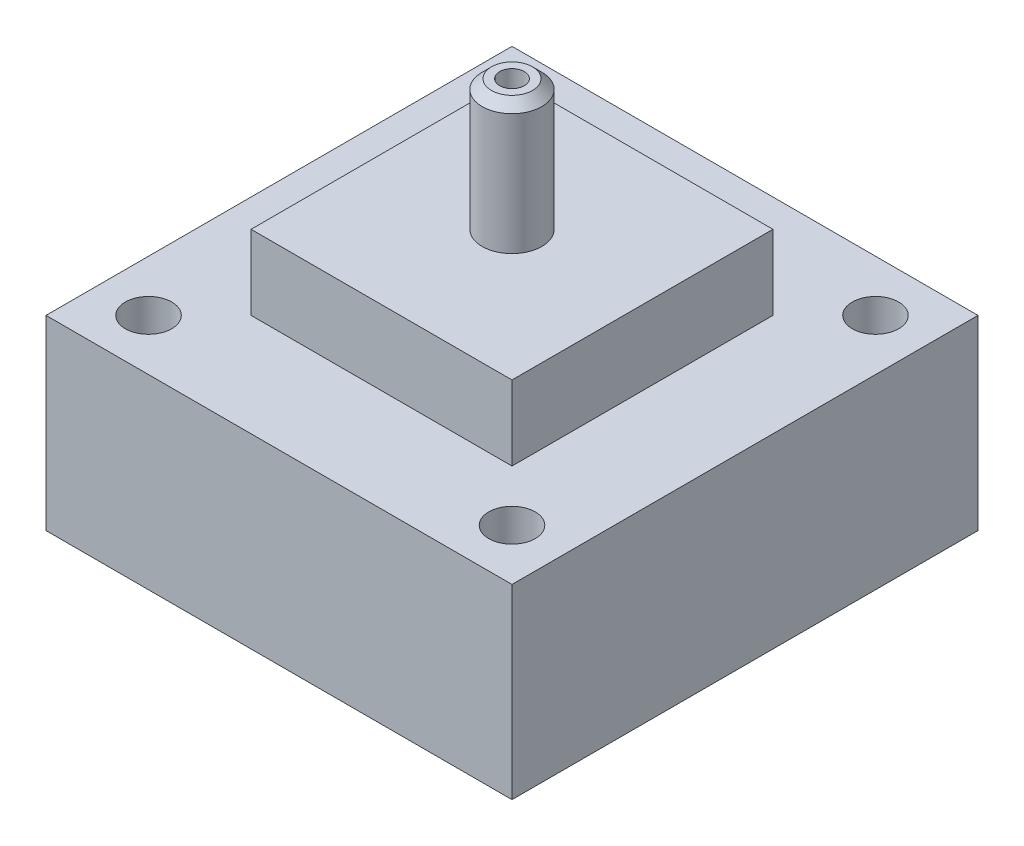
ISO-10303-21;
HEADER;
FILE_DESCRIPTION(('STEP AP214'),'2;1');
FILE_NAME('part.step','',(''),(''),'','','');
FILE_SCHEMA(('AUTOMOTIVE_DESIGN { 1 0 10303 214 1 1 1 1 }'));
ENDSEC;
DATA;
#1=APPLICATION_CONTEXT('core data for automotive mechanical design processes');
#2=APPLICATION_PROTOCOL_DEFINITION('international standard','automotive_design',2000,#1);
#3=PRODUCT_CONTEXT('',#1,'mechanical');
#4=PRODUCT('Part','Part','',(#3));
#5=PRODUCT_RELATED_PRODUCT_CATEGORY('part','',(#4));
#6=PRODUCT_DEFINITION_FORMATION('','',#4);
#7=PRODUCT_DEFINITION_CONTEXT('part definition',#1,'design');
#8=PRODUCT_DEFINITION('design','',#6,#7);
#9=PRODUCT_DEFINITION_SHAPE('','',#8);
#10=(LENGTH_UNIT() NAMED_UNIT(*) SI_UNIT(.MILLI.,.METRE.));
#11=(NAMED_UNIT(*) PLANE_ANGLE_UNIT() SI_UNIT($,.RADIAN.));
#12=(NAMED_UNIT(*) SI_UNIT($,.STERADIAN.) SOLID_ANGLE_UNIT());
#13=UNCERTAINTY_MEASURE_WITH_UNIT(LENGTH_MEASURE(1.E-05),#10,'distance_accuracy_value','');
#14=(GEOMETRIC_REPRESENTATION_CONTEXT(3) GLOBAL_UNCERTAINTY_ASSIGNED_CONTEXT((#13)) GLOBAL_UNIT_ASSIGNED_CONTEXT((#10,
#11,#12)) REPRESENTATION_CONTEXT('',''));
#15=CARTESIAN_POINT('',(0.,0.,0.));
#16=DIRECTION('',(0.,0.,1.));
#17=DIRECTION('',(1.,0.,0.));
#18=AXIS2_PLACEMENT_3D('',#15,#16,#17);
#19=CARTESIAN_POINT('',(-7.,4.,7.));
#20=DIRECTION('',(1.,0.,0.));
#21=DIRECTION('',(0.,0.,-1.));
#22=AXIS2_PLACEMENT_3D('',#19,#20,#21);
#23=PLANE('',#22);
#24=DIRECTION('',(0.,0.,1.));
#25=VECTOR('',#24,1.);
#26=CARTESIAN_POINT('',(-7.,0.,7.));
#27=LINE('',#26,#25);
#28=CARTESIAN_POINT('',(-7.,0.,-7.));
#29=VERTEX_POINT('',#28);
#30=CARTESIAN_POINT('',(-7.,0.,7.));
#31=VERTEX_POINT('',#30);
#32=EDGE_CURVE('E126',#29,#31,#27,.T.);
#33=ORIENTED_EDGE('',*,*,#32,.T.);
#34=DIRECTION('',(0.,-1.,0.));
#35=VECTOR('',#34,1.);
#36=CARTESIAN_POINT('',(-7.,4.,7.));
#37=LINE('',#36,#35);
#38=CARTESIAN_POINT('',(-7.,4.,7.));
#39=VERTEX_POINT('',#38);
#40=EDGE_CURVE('E11',#39,#31,#37,.T.);
#41=ORIENTED_EDGE('',*,*,#40,.F.);
#42=DIRECTION('',(0.,0.,1.));
#43=VECTOR('',#42,1.);
#44=CARTESIAN_POINT('',(-7.,4.,7.));
#45=LINE('',#44,#43);
#46=CARTESIAN_POINT('',(-7.,4.,-7.));
#47=VERTEX_POINT('',#46);
#48=EDGE_CURVE('E135',#47,#39,#45,.T.);
#49=ORIENTED_EDGE('',*,*,#48,.F.);
#50=DIRECTION('',(0.,-1.,0.));
#51=VECTOR('',#50,1.);
#52=CARTESIAN_POINT('',(-7.,4.,-7.));
#53=LINE('',#52,#51);
#54=EDGE_CURVE('E142',#47,#29,#53,.T.);
#55=ORIENTED_EDGE('',*,*,#54,.T.);
#56=EDGE_LOOP('',(#33,#41,#49,#55));
#57=FACE_BOUND('',#56,.T.);
#58=ADVANCED_FACE('F39',(#57),#23,.F.);
#59=CARTESIAN_POINT('',(-7.,4.,7.));
#60=DIRECTION('',(0.,0.,-1.));
#61=DIRECTION('',(-1.,0.,0.));
#62=AXIS2_PLACEMENT_3D('',#59,#60,#61);
#63=PLANE('',#62);
#64=DIRECTION('',(1.,0.,0.));
#65=VECTOR('',#64,1.);
#66=CARTESIAN_POINT('',(-7.,0.,7.));
#67=LINE('',#66,#65);
#68=CARTESIAN_POINT('',(7.,0.,7.));
#69=VERTEX_POINT('',#68);
#70=EDGE_CURVE('E129',#31,#69,#67,.T.);
#71=ORIENTED_EDGE('',*,*,#70,.T.);
#72=DIRECTION('',(0.,-1.,0.));
#73=VECTOR('',#72,1.);
#74=CARTESIAN_POINT('',(7.,4.,7.));
#75=LINE('',#74,#73);
#76=CARTESIAN_POINT('',(7.,4.,7.));
#77=VERTEX_POINT('',#76);
#78=EDGE_CURVE('E48',#77,#69,#75,.T.);
#79=ORIENTED_EDGE('',*,*,#78,.F.);
#80=DIRECTION('',(1.,0.,0.));
#81=VECTOR('',#80,1.);
#82=CARTESIAN_POINT('',(-7.,4.,7.));
#83=LINE('',#82,#81);
#84=EDGE_CURVE('E137',#39,#77,#83,.T.);
#85=ORIENTED_EDGE('',*,*,#84,.F.);
#86=ORIENTED_EDGE('',*,*,#40,.T.);
#87=EDGE_LOOP('',(#71,#79,#85,#86));
#88=FACE_BOUND('',#87,.T.);
#89=ADVANCED_FACE('F164',(#88),#63,.F.);
#90=CARTESIAN_POINT('',(7.,4.,7.));
#91=DIRECTION('',(-1.,0.,0.));
#92=DIRECTION('',(0.,0.,1.));
#93=AXIS2_PLACEMENT_3D('',#90,#91,#92);
#94=PLANE('',#93);
#95=DIRECTION('',(0.,0.,-1.));
#96=VECTOR('',#95,1.);
#97=CARTESIAN_POINT('',(7.,0.,7.));
#98=LINE('',#97,#96);
#99=CARTESIAN_POINT('',(7.,0.,-7.));
#100=VERTEX_POINT('',#99);
#101=EDGE_CURVE('E146',#69,#100,#98,.T.);
#102=ORIENTED_EDGE('',*,*,#101,.T.);
#103=DIRECTION('',(0.,-1.,0.));
#104=VECTOR('',#103,1.);
#105=CARTESIAN_POINT('',(7.,4.,-7.));
#106=LINE('',#105,#104);
#107=CARTESIAN_POINT('',(7.,4.,-7.));
#108=VERTEX_POINT('',#107);
#109=EDGE_CURVE('E153',#108,#100,#106,.T.);
#110=ORIENTED_EDGE('',*,*,#109,.F.);
#111=DIRECTION('',(0.,0.,-1.));
#112=VECTOR('',#111,1.);
#113=CARTESIAN_POINT('',(7.,4.,7.));
#114=LINE('',#113,#112);
#115=EDGE_CURVE('E140',#77,#108,#114,.T.);
#116=ORIENTED_EDGE('',*,*,#115,.F.);
#117=ORIENTED_EDGE('',*,*,#78,.T.);
#118=EDGE_LOOP('',(#102,#110,#116,#117));
#119=FACE_BOUND('',#118,.T.);
#120=ADVANCED_FACE('F160',(#119),#94,.F.);
#121=CARTESIAN_POINT('',(-7.,4.,-7.));
#122=DIRECTION('',(0.,0.,1.));
#123=DIRECTION('',(1.,0.,0.));
#124=AXIS2_PLACEMENT_3D('',#121,#122,#123);
#125=PLANE('',#124);
#126=DIRECTION('',(-1.,0.,0.));
#127=VECTOR('',#126,1.);
#128=CARTESIAN_POINT('',(-7.,0.,-7.));
#129=LINE('',#128,#127);
#130=EDGE_CURVE('E138',#100,#29,#129,.T.);
#131=ORIENTED_EDGE('',*,*,#130,.T.);
#132=ORIENTED_EDGE('',*,*,#54,.F.);
#133=DIRECTION('',(-1.,0.,0.));
#134=VECTOR('',#133,1.);
#135=CARTESIAN_POINT('',(-7.,4.,-7.));
#136=LINE('',#135,#134);
#137=EDGE_CURVE('E55',#108,#47,#136,.T.);
#138=ORIENTED_EDGE('',*,*,#137,.F.);
#139=ORIENTED_EDGE('',*,*,#109,.T.);
#140=EDGE_LOOP('',(#131,#132,#138,#139));
#141=FACE_BOUND('',#140,.T.);
#142=ADVANCED_FACE('F170',(#141),#125,.F.);
#143=CARTESIAN_POINT('',(0.,4.,0.));
#144=DIRECTION('',(0.,-1.,0.));
#145=DIRECTION('',(0.,0.,-1.));
#146=AXIS2_PLACEMENT_3D('',#143,#144,#145);
#147=PLANE('',#146);
#148=CARTESIAN_POINT('',(0.,4.,0.));
#149=DIRECTION('',(0.,-1.,0.));
#150=DIRECTION('',(0.,0.,-1.));
#151=AXIS2_PLACEMENT_3D('',#148,#149,#150);
#152=CIRCLE('',#151,1.6);
#153=CARTESIAN_POINT('',(0.,4.,-1.6));
#154=VERTEX_POINT('',#153);
#155=EDGE_CURVE('E352',#154,#154,#152,.T.);
#156=ORIENTED_EDGE('',*,*,#155,.T.);
#157=EDGE_LOOP('',(#156));
#158=FACE_BOUND('',#157,.T.);
#159=ORIENTED_EDGE('',*,*,#48,.T.);
#160=ORIENTED_EDGE('',*,*,#84,.T.);
#161=ORIENTED_EDGE('',*,*,#115,.T.);
#162=ORIENTED_EDGE('',*,*,#137,.T.);
#163=EDGE_LOOP('',(#159,#160,#161,#162));
#164=FACE_BOUND('',#163,.T.);
#165=ADVANCED_FACE('F173',(#158,#164),#147,.F.);
#166=CARTESIAN_POINT('',(0.,-10.,0.));
#167=DIRECTION('',(0.,-1.,0.));
#168=DIRECTION('',(0.,0.,-1.));
#169=AXIS2_PLACEMENT_3D('',#166,#167,#168);
#170=PLANE('',#169);
#171=CARTESIAN_POINT('',(0.,-10.,0.));
#172=DIRECTION('',(0.,-1.,0.));
#173=DIRECTION('',(0.,0.,-1.));
#174=AXIS2_PLACEMENT_3D('',#171,#172,#173);
#175=CIRCLE('',#174,4.23);
#176=CARTESIAN_POINT('',(0.,-10.,-4.23));
#177=VERTEX_POINT('',#176);
#178=EDGE_CURVE('E360',#177,#177,#175,.T.);
#179=ORIENTED_EDGE('',*,*,#178,.F.);
#180=EDGE_LOOP('',(#179));
#181=FACE_BOUND('',#180,.T.);
#182=CARTESIAN_POINT('',(9.74999999999993,-10.,-9.75000000000006));
#183=DIRECTION('',(0.,-1.,0.));
#184=DIRECTION('',(0.,0.,-1.));
#185=AXIS2_PLACEMENT_3D('',#182,#183,#184);
#186=CIRCLE('',#185,1.2446);
#187=CARTESIAN_POINT('',(9.74999999999993,-10.,-10.9946000000001));
#188=VERTEX_POINT('',#187);
#189=EDGE_CURVE('E373',#188,#188,#186,.T.);
#190=ORIENTED_EDGE('',*,*,#189,.F.);
#191=EDGE_LOOP('',(#190));
#192=FACE_BOUND('',#191,.T.);
#193=CARTESIAN_POINT('',(-9.75,-10.,9.75));
#194=DIRECTION('',(0.,-1.,0.));
#195=DIRECTION('',(0.,0.,-1.));
#196=AXIS2_PLACEMENT_3D('',#193,#194,#195);
#197=CIRCLE('',#196,1.2446);
#198=CARTESIAN_POINT('',(-9.75,-10.,8.5054));
#199=VERTEX_POINT('',#198);
#200=EDGE_CURVE('E385',#199,#199,#197,.T.);
#201=ORIENTED_EDGE('',*,*,#200,.F.);
#202=EDGE_LOOP('',(#201));
#203=FACE_BOUND('',#202,.T.);
#204=DIRECTION('',(1.,0.,0.));
#205=VECTOR('',#204,1.);
#206=CARTESIAN_POINT('',(-12.5,-10.,-12.5));
#207=LINE('',#206,#205);
#208=CARTESIAN_POINT('',(-12.5,-10.,-12.5));
#209=VERTEX_POINT('',#208);
#210=CARTESIAN_POINT('',(12.5,-10.,-12.5));
#211=VERTEX_POINT('',#210);
#212=EDGE_CURVE('E111',#209,#211,#207,.T.);
#213=ORIENTED_EDGE('',*,*,#212,.T.);
#214=DIRECTION('',(0.,0.,1.));
#215=VECTOR('',#214,1.);
#216=CARTESIAN_POINT('',(12.5,-10.,-12.5));
#217=LINE('',#216,#215);
#218=CARTESIAN_POINT('',(12.5,-10.,12.5));
#219=VERTEX_POINT('',#218);
#220=EDGE_CURVE('E100',#211,#219,#217,.T.);
#221=ORIENTED_EDGE('',*,*,#220,.T.);
#222=DIRECTION('',(-1.,0.,0.));
#223=VECTOR('',#222,1.);
#224=CARTESIAN_POINT('',(-12.5,-10.,12.5));
#225=LINE('',#224,#223);
#226=CARTESIAN_POINT('',(-12.5,-10.,12.5));
#227=VERTEX_POINT('',#226);
#228=EDGE_CURVE('E110',#219,#227,#225,.T.);
#229=ORIENTED_EDGE('',*,*,#228,.T.);
#230=DIRECTION('',(0.,0.,-1.));
#231=VECTOR('',#230,1.);
#232=CARTESIAN_POINT('',(-12.5,-10.,-12.5));
#233=LINE('',#232,#231);
#234=EDGE_CURVE('E117',#227,#209,#233,.T.);
#235=ORIENTED_EDGE('',*,*,#234,.T.);
#236=EDGE_LOOP('',(#213,#221,#229,#235));
#237=FACE_BOUND('',#236,.T.);
#238=CARTESIAN_POINT('',(9.75000000000004,-10.,9.74999999999996));
#239=DIRECTION('',(0.,-1.,0.));
#240=DIRECTION('',(0.,0.,-1.));
#241=AXIS2_PLACEMENT_3D('',#238,#239,#240);
#242=CIRCLE('',#241,1.2446);
#243=CARTESIAN_POINT('',(9.75000000000004,-10.,8.50539999999996));
#244=VERTEX_POINT('',#243);
#245=EDGE_CURVE('E379',#244,#244,#242,.T.);
#246=ORIENTED_EDGE('',*,*,#245,.F.);
#247=EDGE_LOOP('',(#246));
#248=FACE_BOUND('',#247,.T.);
#249=CARTESIAN_POINT('',(-9.7500000000001,-10.,-9.7499999999999));
#250=DIRECTION('',(0.,-1.,0.));
#251=DIRECTION('',(0.,0.,-1.));
#252=AXIS2_PLACEMENT_3D('',#249,#250,#251);
#253=CIRCLE('',#252,1.2446);
#254=CARTESIAN_POINT('',(-9.7500000000001,-10.,-10.9945999999999));
#255=VERTEX_POINT('',#254);
#256=EDGE_CURVE('E367',#255,#255,#253,.T.);
#257=ORIENTED_EDGE('',*,*,#256,.F.);
#258=EDGE_LOOP('',(#257));
#259=FACE_BOUND('',#258,.T.);
#260=ADVANCED_FACE('F114',(#181,#192,#203,#237,#248,#259),#170,.T.);
#261=CARTESIAN_POINT('',(0.,0.,0.));
#262=DIRECTION('',(0.,-1.,0.));
#263=DIRECTION('',(0.,0.,-1.));
#264=AXIS2_PLACEMENT_3D('',#261,#262,#263);
#265=PLANE('',#264);
#266=ORIENTED_EDGE('',*,*,#32,.F.);
#267=ORIENTED_EDGE('',*,*,#130,.F.);
#268=ORIENTED_EDGE('',*,*,#101,.F.);
#269=ORIENTED_EDGE('',*,*,#70,.F.);
#270=EDGE_LOOP('',(#266,#267,#268,#269));
#271=FACE_BOUND('',#270,.T.);
#272=DIRECTION('',(1.,0.,0.));
#273=VECTOR('',#272,1.);
#274=CARTESIAN_POINT('',(-12.5,0.,-12.5));
#275=LINE('',#274,#273);
#276=CARTESIAN_POINT('',(-12.5,0.,-12.5));
#277=VERTEX_POINT('',#276);
#278=CARTESIAN_POINT('',(12.5,0.,-12.5));
#279=VERTEX_POINT('',#278);
#280=EDGE_CURVE('E125',#277,#279,#275,.T.);
#281=ORIENTED_EDGE('',*,*,#280,.F.);
#282=DIRECTION('',(0.,0.,-1.));
#283=VECTOR('',#282,1.);
#284=CARTESIAN_POINT('',(-12.5,0.,-12.5));
#285=LINE('',#284,#283);
#286=CARTESIAN_POINT('',(-12.5,0.,12.5));
#287=VERTEX_POINT('',#286);
#288=EDGE_CURVE('E121',#287,#277,#285,.T.);
#289=ORIENTED_EDGE('',*,*,#288,.F.);
#290=DIRECTION('',(-1.,0.,0.));
#291=VECTOR('',#290,1.);
#292=CARTESIAN_POINT('',(-12.5,0.,12.5));
#293=LINE('',#292,#291);
#294=CARTESIAN_POINT('',(12.5,0.,12.5));
#295=VERTEX_POINT('',#294);
#296=EDGE_CURVE('E396',#295,#287,#293,.T.);
#297=ORIENTED_EDGE('',*,*,#296,.F.);
#298=DIRECTION('',(0.,0.,1.));
#299=VECTOR('',#298,1.);
#300=CARTESIAN_POINT('',(12.5,0.,-12.5));
#301=LINE('',#300,#299);
#302=EDGE_CURVE('E394',#279,#295,#301,.T.);
#303=ORIENTED_EDGE('',*,*,#302,.F.);
#304=EDGE_LOOP('',(#281,#289,#297,#303));
#305=FACE_BOUND('',#304,.T.);
#306=CARTESIAN_POINT('',(-9.75,0.,9.75));
#307=DIRECTION('',(0.,-1.,0.));
#308=DIRECTION('',(0.,0.,-1.));
#309=AXIS2_PLACEMENT_3D('',#306,#307,#308);
#310=CIRCLE('',#309,1.2446);
#311=CARTESIAN_POINT('',(-9.75,0.,8.5054));
#312=VERTEX_POINT('',#311);
#313=EDGE_CURVE('E382',#312,#312,#310,.T.);
#314=ORIENTED_EDGE('',*,*,#313,.T.);
#315=EDGE_LOOP('',(#314));
#316=FACE_BOUND('',#315,.T.);
#317=CARTESIAN_POINT('',(9.75000000000004,0.,9.74999999999996));
#318=DIRECTION('',(0.,-1.,0.));
#319=DIRECTION('',(0.,0.,-1.));
#320=AXIS2_PLACEMENT_3D('',#317,#318,#319);
#321=CIRCLE('',#320,1.2446);
#322=CARTESIAN_POINT('',(9.75000000000004,0.,8.50539999999996));
#323=VERTEX_POINT('',#322);
#324=EDGE_CURVE('E376',#323,#323,#321,.T.);
#325=ORIENTED_EDGE('',*,*,#324,.T.);
#326=EDGE_LOOP('',(#325));
#327=FACE_BOUND('',#326,.T.);
#328=CARTESIAN_POINT('',(9.74999999999993,0.,-9.75000000000006));
#329=DIRECTION('',(0.,-1.,0.));
#330=DIRECTION('',(0.,0.,-1.));
#331=AXIS2_PLACEMENT_3D('',#328,#329,#330);
#332=CIRCLE('',#331,1.2446);
#333=CARTESIAN_POINT('',(9.74999999999993,0.,-10.9946000000001));
#334=VERTEX_POINT('',#333);
#335=EDGE_CURVE('E370',#334,#334,#332,.T.);
#336=ORIENTED_EDGE('',*,*,#335,.T.);
#337=EDGE_LOOP('',(#336));
#338=FACE_BOUND('',#337,.T.);
#339=CARTESIAN_POINT('',(-9.7500000000001,0.,-9.7499999999999));
#340=DIRECTION('',(0.,-1.,0.));
#341=DIRECTION('',(0.,0.,-1.));
#342=AXIS2_PLACEMENT_3D('',#339,#340,#341);
#343=CIRCLE('',#342,1.2446);
#344=CARTESIAN_POINT('',(-9.7500000000001,0.,-10.9945999999999));
#345=VERTEX_POINT('',#344);
#346=EDGE_CURVE('E364',#345,#345,#343,.T.);
#347=ORIENTED_EDGE('',*,*,#346,.T.);
#348=EDGE_LOOP('',(#347));
#349=FACE_BOUND('',#348,.T.);
#350=ADVANCED_FACE('F167',(#271,#305,#316,#327,#338,#349),#265,.F.);
#351=CARTESIAN_POINT('',(-12.5,-10.,-12.5));
#352=DIRECTION('',(0.,0.,1.));
#353=DIRECTION('',(1.,0.,0.));
#354=AXIS2_PLACEMENT_3D('',#351,#352,#353);
#355=PLANE('',#354);
#356=ORIENTED_EDGE('',*,*,#280,.T.);
#357=DIRECTION('',(0.,1.,0.));
#358=VECTOR('',#357,1.);
#359=CARTESIAN_POINT('',(12.5,-10.,-12.5));
#360=LINE('',#359,#358);
#361=EDGE_CURVE('E104',#211,#279,#360,.T.);
#362=ORIENTED_EDGE('',*,*,#361,.F.);
#363=ORIENTED_EDGE('',*,*,#212,.F.);
#364=DIRECTION('',(0.,1.,0.));
#365=VECTOR('',#364,1.);
#366=CARTESIAN_POINT('',(-12.5,-10.,-12.5));
#367=LINE('',#366,#365);
#368=EDGE_CURVE('E392',#209,#277,#367,.T.);
#369=ORIENTED_EDGE('',*,*,#368,.T.);
#370=EDGE_LOOP('',(#356,#362,#363,#369));
#371=FACE_BOUND('',#370,.T.);
#372=ADVANCED_FACE('F123',(#371),#355,.F.);
#373=CARTESIAN_POINT('',(12.5,-10.,-12.5));
#374=DIRECTION('',(-1.,0.,0.));
#375=DIRECTION('',(0.,0.,1.));
#376=AXIS2_PLACEMENT_3D('',#373,#374,#375);
#377=PLANE('',#376);
#378=ORIENTED_EDGE('',*,*,#302,.T.);
#379=DIRECTION('',(0.,1.,0.));
#380=VECTOR('',#379,1.);
#381=CARTESIAN_POINT('',(12.5,-10.,12.5));
#382=LINE('',#381,#380);
#383=EDGE_CURVE('E107',#219,#295,#382,.T.);
#384=ORIENTED_EDGE('',*,*,#383,.F.);
#385=ORIENTED_EDGE('',*,*,#220,.F.);
#386=ORIENTED_EDGE('',*,*,#361,.T.);
#387=EDGE_LOOP('',(#378,#384,#385,#386));
#388=FACE_BOUND('',#387,.T.);
#389=ADVANCED_FACE('F102',(#388),#377,.F.);
#390=CARTESIAN_POINT('',(-12.5,-10.,12.5));
#391=DIRECTION('',(0.,0.,-1.));
#392=DIRECTION('',(-1.,0.,0.));
#393=AXIS2_PLACEMENT_3D('',#390,#391,#392);
#394=PLANE('',#393);
#395=ORIENTED_EDGE('',*,*,#296,.T.);
#396=DIRECTION('',(0.,1.,0.));
#397=VECTOR('',#396,1.);
#398=CARTESIAN_POINT('',(-12.5,-10.,12.5));
#399=LINE('',#398,#397);
#400=EDGE_CURVE('E131',#227,#287,#399,.T.);
#401=ORIENTED_EDGE('',*,*,#400,.F.);
#402=ORIENTED_EDGE('',*,*,#228,.F.);
#403=ORIENTED_EDGE('',*,*,#383,.T.);
#404=EDGE_LOOP('',(#395,#401,#402,#403));
#405=FACE_BOUND('',#404,.T.);
#406=ADVANCED_FACE('F224',(#405),#394,.F.);
#407=CARTESIAN_POINT('',(-12.5,-10.,-12.5));
#408=DIRECTION('',(1.,0.,0.));
#409=DIRECTION('',(0.,0.,-1.));
#410=AXIS2_PLACEMENT_3D('',#407,#408,#409);
#411=PLANE('',#410);
#412=ORIENTED_EDGE('',*,*,#288,.T.);
#413=ORIENTED_EDGE('',*,*,#368,.F.);
#414=ORIENTED_EDGE('',*,*,#234,.F.);
#415=ORIENTED_EDGE('',*,*,#400,.T.);
#416=EDGE_LOOP('',(#412,#413,#414,#415));
#417=FACE_BOUND('',#416,.T.);
#418=ADVANCED_FACE('F232',(#417),#411,.F.);
#419=CARTESIAN_POINT('',(-9.75,-10.,9.75));
#420=DIRECTION('',(0.,1.,0.));
#421=DIRECTION('',(0.,0.,1.));
#422=AXIS2_PLACEMENT_3D('',#419,#420,#421);
#423=CYLINDRICAL_SURFACE('',#422,1.2446);
#424=ORIENTED_EDGE('',*,*,#200,.T.);
#425=EDGE_LOOP('',(#424));
#426=FACE_BOUND('',#425,.T.);
#427=ORIENTED_EDGE('',*,*,#313,.F.);
#428=EDGE_LOOP('',(#427));
#429=FACE_BOUND('',#428,.T.);
#430=ADVANCED_FACE('F241',(#426,#429),#423,.F.);
#431=CARTESIAN_POINT('',(9.75000000000004,-10.,9.74999999999996));
#432=DIRECTION('',(0.,1.,0.));
#433=DIRECTION('',(0.,0.,1.));
#434=AXIS2_PLACEMENT_3D('',#431,#432,#433);
#435=CYLINDRICAL_SURFACE('',#434,1.2446);
#436=ORIENTED_EDGE('',*,*,#245,.T.);
#437=EDGE_LOOP('',(#436));
#438=FACE_BOUND('',#437,.T.);
#439=ORIENTED_EDGE('',*,*,#324,.F.);
#440=EDGE_LOOP('',(#439));
#441=FACE_BOUND('',#440,.T.);
#442=ADVANCED_FACE('F250',(#438,#441),#435,.F.);
#443=CARTESIAN_POINT('',(9.74999999999993,-10.,-9.75000000000006));
#444=DIRECTION('',(0.,1.,0.));
#445=DIRECTION('',(0.,0.,1.));
#446=AXIS2_PLACEMENT_3D('',#443,#444,#445);
#447=CYLINDRICAL_SURFACE('',#446,1.2446);
#448=ORIENTED_EDGE('',*,*,#189,.T.);
#449=EDGE_LOOP('',(#448));
#450=FACE_BOUND('',#449,.T.);
#451=ORIENTED_EDGE('',*,*,#335,.F.);
#452=EDGE_LOOP('',(#451));
#453=FACE_BOUND('',#452,.T.);
#454=ADVANCED_FACE('F259',(#450,#453),#447,.F.);
#455=CARTESIAN_POINT('',(-9.7500000000001,-10.,-9.7499999999999));
#456=DIRECTION('',(0.,1.,0.));
#457=DIRECTION('',(0.,0.,1.));
#458=AXIS2_PLACEMENT_3D('',#455,#456,#457);
#459=CYLINDRICAL_SURFACE('',#458,1.2446);
#460=ORIENTED_EDGE('',*,*,#256,.T.);
#461=EDGE_LOOP('',(#460));
#462=FACE_BOUND('',#461,.T.);
#463=ORIENTED_EDGE('',*,*,#346,.F.);
#464=EDGE_LOOP('',(#463));
#465=FACE_BOUND('',#464,.T.);
#466=ADVANCED_FACE('F268',(#462,#465),#459,.F.);
#467=CARTESIAN_POINT('',(0.,-0.199999999999999,0.));
#468=DIRECTION('',(0.,-1.,0.));
#469=DIRECTION('',(0.,0.,-1.));
#470=AXIS2_PLACEMENT_3D('',#467,#468,#469);
#471=CYLINDRICAL_SURFACE('',#470,4.23);
#472=CARTESIAN_POINT('',(0.,-0.199999999999999,0.));
#473=DIRECTION('',(0.,-1.,0.));
#474=DIRECTION('',(0.,0.,-1.));
#475=AXIS2_PLACEMENT_3D('',#472,#473,#474);
#476=CIRCLE('',#475,4.23);
#477=CARTESIAN_POINT('',(0.,-0.199999999999999,-4.23));
#478=VERTEX_POINT('',#477);
#479=EDGE_CURVE('E361',#478,#478,#476,.T.);
#480=ORIENTED_EDGE('',*,*,#479,.F.);
#481=EDGE_LOOP('',(#480));
#482=FACE_BOUND('',#481,.T.);
#483=ORIENTED_EDGE('',*,*,#178,.T.);
#484=EDGE_LOOP('',(#483));
#485=FACE_BOUND('',#484,.T.);
#486=ADVANCED_FACE('F276',(#482,#485),#471,.F.);
#487=CARTESIAN_POINT('',(0.,-0.199999999999999,0.));
#488=DIRECTION('',(0.,-1.,0.));
#489=DIRECTION('',(0.,0.,-1.));
#490=AXIS2_PLACEMENT_3D('',#487,#488,#489);
#491=PLANE('',#490);
#492=CARTESIAN_POINT('',(0.,-0.199999999999999,0.));
#493=DIRECTION('',(0.,-1.,0.));
#494=DIRECTION('',(0.,0.,-1.));
#495=AXIS2_PLACEMENT_3D('',#492,#493,#494);
#496=CIRCLE('',#495,0.660399999999999);
#497=CARTESIAN_POINT('',(0.,-0.199999999999999,-0.660399999999999));
#498=VERTEX_POINT('',#497);
#499=EDGE_CURVE('E42',#498,#498,#496,.T.);
#500=ORIENTED_EDGE('',*,*,#499,.F.);
#501=EDGE_LOOP('',(#500));
#502=FACE_BOUND('',#501,.T.);
#503=ORIENTED_EDGE('',*,*,#479,.T.);
#504=EDGE_LOOP('',(#503));
#505=FACE_BOUND('',#504,.T.);
#506=ADVANCED_FACE('F288',(#502,#505),#491,.T.);
#507=CARTESIAN_POINT('',(0.,11.,-1.1));
#508=DIRECTION('',(0.,1.,0.));
#509=DIRECTION('',(0.,0.,1.));
#510=AXIS2_PLACEMENT_3D('',#507,#508,#509);
#511=PLANE('',#510);
#512=CARTESIAN_POINT('',(0.,11.,0.));
#513=DIRECTION('',(0.,-1.,0.));
#514=DIRECTION('',(0.,0.,-1.));
#515=AXIS2_PLACEMENT_3D('',#512,#513,#514);
#516=CIRCLE('',#515,0.660399999999999);
#517=CARTESIAN_POINT('',(0.,11.,-0.6604));
#518=VERTEX_POINT('',#517);
#519=EDGE_CURVE('E354',#518,#518,#516,.T.);
#520=ORIENTED_EDGE('',*,*,#519,.T.);
#521=EDGE_LOOP('',(#520));
#522=FACE_BOUND('',#521,.T.);
#523=CARTESIAN_POINT('',(0.,11.,0.));
#524=DIRECTION('',(0.,-1.,0.));
#525=DIRECTION('',(0.,0.,-1.));
#526=AXIS2_PLACEMENT_3D('',#523,#524,#525);
#527=CIRCLE('',#526,1.1);
#528=CARTESIAN_POINT('',(0.,11.,-1.1));
#529=VERTEX_POINT('',#528);
#530=EDGE_CURVE('E348',#529,#529,#527,.T.);
#531=ORIENTED_EDGE('',*,*,#530,.F.);
#532=EDGE_LOOP('',(#531));
#533=FACE_BOUND('',#532,.T.);
#534=ADVANCED_FACE('F301',(#522,#533),#511,.T.);
#535=CARTESIAN_POINT('',(0.,4.,0.));
#536=DIRECTION('',(0.,-1.,0.));
#537=DIRECTION('',(0.,0.,-1.));
#538=AXIS2_PLACEMENT_3D('',#535,#536,#537);
#539=CYLINDRICAL_SURFACE('',#538,0.6604);
#540=ORIENTED_EDGE('',*,*,#519,.F.);
#541=EDGE_LOOP('',(#540));
#542=FACE_BOUND('',#541,.T.);
#543=ORIENTED_EDGE('',*,*,#499,.T.);
#544=EDGE_LOOP('',(#543));
#545=FACE_BOUND('',#544,.T.);
#546=ADVANCED_FACE('F312',(#542,#545),#539,.F.);
#547=CARTESIAN_POINT('',(0.,4.,0.));
#548=DIRECTION('',(0.,-1.,0.));
#549=DIRECTION('',(0.,0.,-1.));
#550=AXIS2_PLACEMENT_3D('',#547,#548,#549);
#551=CYLINDRICAL_SURFACE('',#550,1.6);
#552=CARTESIAN_POINT('',(0.,10.5,0.));
#553=DIRECTION('',(0.,-1.,0.));
#554=DIRECTION('',(0.,0.,-1.));
#555=AXIS2_PLACEMENT_3D('',#552,#553,#554);
#556=CIRCLE('',#555,1.6);
#557=CARTESIAN_POINT('',(0.,10.5,-1.6));
#558=VERTEX_POINT('',#557);
#559=EDGE_CURVE('E351',#558,#558,#556,.T.);
#560=ORIENTED_EDGE('',*,*,#559,.T.);
#561=EDGE_LOOP('',(#560));
#562=FACE_BOUND('',#561,.T.);
#563=ORIENTED_EDGE('',*,*,#155,.F.);
#564=EDGE_LOOP('',(#563));
#565=FACE_BOUND('',#564,.T.);
#566=ADVANCED_FACE('F323',(#562,#565),#551,.T.);
#567=CARTESIAN_POINT('',(0.,10.5,0.));
#568=DIRECTION('',(0.,-1.,0.));
#569=DIRECTION('',(0.,0.,-1.));
#570=AXIS2_PLACEMENT_3D('',#567,#568,#569);
#571=CONICAL_SURFACE('',#570,1.6,0.785398163397443);
#572=ORIENTED_EDGE('',*,*,#530,.T.);
#573=EDGE_LOOP('',(#572));
#574=FACE_BOUND('',#573,.T.);
#575=ORIENTED_EDGE('',*,*,#559,.F.);
#576=EDGE_LOOP('',(#575));
#577=FACE_BOUND('',#576,.T.);
#578=ADVANCED_FACE('F333',(#574,#577),#571,.T.);
#579=CLOSED_SHELL('',(#58,#89,#120,#142,#165,#260,#350,#372,#389,#406,#418,#430,#442,#454,#466,
#486,#506,#534,#546,#566,#578));
#580=MANIFOLD_SOLID_BREP('B2',#579);
#581=ADVANCED_BREP_SHAPE_REPRESENTATION('',(#18,#580),#14);
#582=SHAPE_DEFINITION_REPRESENTATION(#9,#581);
ENDSEC;
END-ISO-10303-21;
